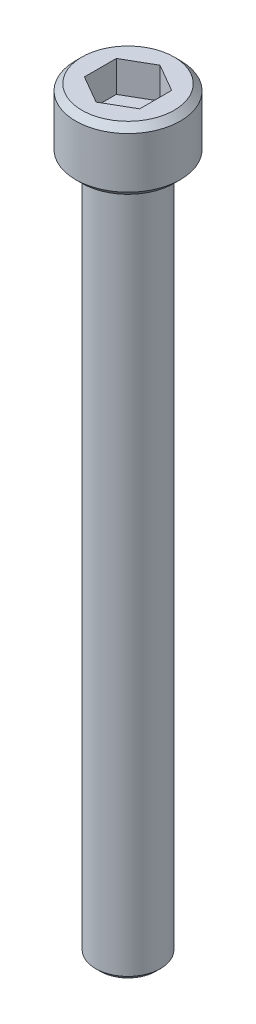
ISO-10303-21;
HEADER;
FILE_DESCRIPTION(('STEP AP214'),'2;1');
FILE_NAME('part.step','',(''),(''),'','','');
FILE_SCHEMA(('AUTOMOTIVE_DESIGN { 1 0 10303 214 1 1 1 1 }'));
ENDSEC;
DATA;
#1=APPLICATION_CONTEXT('core data for automotive mechanical design processes');
#2=APPLICATION_PROTOCOL_DEFINITION('international standard','automotive_design',2000,#1);
#3=PRODUCT_CONTEXT('',#1,'mechanical');
#4=PRODUCT('Part','Part','',(#3));
#5=PRODUCT_RELATED_PRODUCT_CATEGORY('part','',(#4));
#6=PRODUCT_DEFINITION_FORMATION('','',#4);
#7=PRODUCT_DEFINITION_CONTEXT('part definition',#1,'design');
#8=PRODUCT_DEFINITION('design','',#6,#7);
#9=PRODUCT_DEFINITION_SHAPE('','',#8);
#10=(LENGTH_UNIT() NAMED_UNIT(*) SI_UNIT(.MILLI.,.METRE.));
#11=(NAMED_UNIT(*) PLANE_ANGLE_UNIT() SI_UNIT($,.RADIAN.));
#12=(NAMED_UNIT(*) SI_UNIT($,.STERADIAN.) SOLID_ANGLE_UNIT());
#13=UNCERTAINTY_MEASURE_WITH_UNIT(LENGTH_MEASURE(1.E-05),#10,'distance_accuracy_value','');
#14=(GEOMETRIC_REPRESENTATION_CONTEXT(3) GLOBAL_UNCERTAINTY_ASSIGNED_CONTEXT((#13)) GLOBAL_UNIT_ASSIGNED_CONTEXT((#10,
#11,#12)) REPRESENTATION_CONTEXT('',''));
#15=CARTESIAN_POINT('',(0.,0.,0.));
#16=DIRECTION('',(0.,0.,1.));
#17=DIRECTION('',(1.,0.,0.));
#18=AXIS2_PLACEMENT_3D('',#15,#16,#17);
#19=CARTESIAN_POINT('',(1.778,2.064,3.07958633585746));
#20=DIRECTION('',(0.,1.,0.));
#21=DIRECTION('',(0.,0.,1.));
#22=AXIS2_PLACEMENT_3D('',#19,#20,#21);
#23=PLANE('',#22);
#24=DIRECTION('',(-0.866025403784439,0.,0.5));
#25=VECTOR('',#24,1.);
#26=CARTESIAN_POINT('',(0.,2.064,-2.05305755723831));
#27=LINE('',#26,#25);
#28=CARTESIAN_POINT('',(0.,2.064,-2.05305755723831));
#29=VERTEX_POINT('',#28);
#30=CARTESIAN_POINT('',(-1.778,2.064,-1.02652877861915));
#31=VERTEX_POINT('',#30);
#32=EDGE_CURVE('E67',#29,#31,#27,.T.);
#33=ORIENTED_EDGE('',*,*,#32,.T.);
#34=DIRECTION('',(0.,0.,1.));
#35=VECTOR('',#34,1.);
#36=CARTESIAN_POINT('',(-1.778,2.064,-1.02652877861915));
#37=LINE('',#36,#35);
#38=CARTESIAN_POINT('',(-1.778,2.064,1.02652877861916));
#39=VERTEX_POINT('',#38);
#40=EDGE_CURVE('E69',#31,#39,#37,.T.);
#41=ORIENTED_EDGE('',*,*,#40,.T.);
#42=DIRECTION('',(0.866025403784439,0.,0.499999999999999));
#43=VECTOR('',#42,1.);
#44=CARTESIAN_POINT('',(-1.778,2.064,1.02652877861916));
#45=LINE('',#44,#43);
#46=CARTESIAN_POINT('',(0.,2.064,2.05305755723831));
#47=VERTEX_POINT('',#46);
#48=EDGE_CURVE('E71',#39,#47,#45,.T.);
#49=ORIENTED_EDGE('',*,*,#48,.T.);
#50=DIRECTION('',(0.866025403784438,0.,-0.500000000000001));
#51=VECTOR('',#50,1.);
#52=CARTESIAN_POINT('',(0.,2.064,2.05305755723831));
#53=LINE('',#52,#51);
#54=CARTESIAN_POINT('',(1.778,2.064,1.02652877861915));
#55=VERTEX_POINT('',#54);
#56=EDGE_CURVE('E126',#47,#55,#53,.T.);
#57=ORIENTED_EDGE('',*,*,#56,.T.);
#58=DIRECTION('',(0.,0.,-1.));
#59=VECTOR('',#58,1.);
#60=CARTESIAN_POINT('',(1.778,2.064,1.02652877861915));
#61=LINE('',#60,#59);
#62=CARTESIAN_POINT('',(1.778,2.064,-1.02652877861916));
#63=VERTEX_POINT('',#62);
#64=EDGE_CURVE('E131',#55,#63,#61,.T.);
#65=ORIENTED_EDGE('',*,*,#64,.T.);
#66=DIRECTION('',(-0.866025403784439,0.,-0.499999999999999));
#67=VECTOR('',#66,1.);
#68=CARTESIAN_POINT('',(1.778,2.064,-1.02652877861916));
#69=LINE('',#68,#67);
#70=EDGE_CURVE('E135',#63,#29,#69,.T.);
#71=ORIENTED_EDGE('',*,*,#70,.T.);
#72=EDGE_LOOP('',(#33,#41,#49,#57,#65,#71));
#73=FACE_BOUND('',#72,.T.);
#74=ADVANCED_FACE('F16',(#73),#23,.T.);
#75=CARTESIAN_POINT('',(-1.778,2.064,1.02652877861916));
#76=DIRECTION('',(-0.499999999999999,0.,0.866025403784439));
#77=DIRECTION('',(0.866025403784439,0.,0.499999999999999));
#78=AXIS2_PLACEMENT_3D('',#75,#76,#77);
#79=PLANE('',#78);
#80=DIRECTION('',(0.,1.,0.));
#81=VECTOR('',#80,1.);
#82=CARTESIAN_POINT('',(0.,2.064,2.05305755723831));
#83=LINE('',#82,#81);
#84=CARTESIAN_POINT('',(0.,4.064,2.05305755723831));
#85=VERTEX_POINT('',#84);
#86=EDGE_CURVE('E82',#85,#47,#83,.F.);
#87=ORIENTED_EDGE('',*,*,#86,.T.);
#88=ORIENTED_EDGE('',*,*,#48,.F.);
#89=DIRECTION('',(0.,1.,0.));
#90=VECTOR('',#89,1.);
#91=CARTESIAN_POINT('',(-1.778,2.064,1.02652877861916));
#92=LINE('',#91,#90);
#93=CARTESIAN_POINT('',(-1.778,4.064,1.02652877861916));
#94=VERTEX_POINT('',#93);
#95=EDGE_CURVE('E76',#39,#94,#92,.T.);
#96=ORIENTED_EDGE('',*,*,#95,.T.);
#97=DIRECTION('',(-0.866025403784439,0.,-0.5));
#98=VECTOR('',#97,1.);
#99=CARTESIAN_POINT('',(0.,4.064,2.05305755723831));
#100=LINE('',#99,#98);
#101=EDGE_CURVE('E123',#85,#94,#100,.T.);
#102=ORIENTED_EDGE('',*,*,#101,.F.);
#103=EDGE_LOOP('',(#87,#88,#96,#102));
#104=FACE_BOUND('',#103,.T.);
#105=ADVANCED_FACE('F79',(#104),#79,.F.);
#106=CARTESIAN_POINT('',(-1.778,2.064,-1.02652877861915));
#107=DIRECTION('',(-1.,0.,0.));
#108=DIRECTION('',(0.,0.,1.));
#109=AXIS2_PLACEMENT_3D('',#106,#107,#108);
#110=PLANE('',#109);
#111=ORIENTED_EDGE('',*,*,#95,.F.);
#112=ORIENTED_EDGE('',*,*,#40,.F.);
#113=DIRECTION('',(0.,1.,0.));
#114=VECTOR('',#113,1.);
#115=CARTESIAN_POINT('',(-1.778,2.064,-1.02652877861915));
#116=LINE('',#115,#114);
#117=CARTESIAN_POINT('',(-1.778,4.064,-1.02652877861915));
#118=VERTEX_POINT('',#117);
#119=EDGE_CURVE('E90',#31,#118,#116,.T.);
#120=ORIENTED_EDGE('',*,*,#119,.T.);
#121=DIRECTION('',(0.,0.,1.));
#122=VECTOR('',#121,1.);
#123=CARTESIAN_POINT('',(-1.778,4.064,0.));
#124=LINE('',#123,#122);
#125=EDGE_CURVE('E87',#94,#118,#124,.F.);
#126=ORIENTED_EDGE('',*,*,#125,.F.);
#127=EDGE_LOOP('',(#111,#112,#120,#126));
#128=FACE_BOUND('',#127,.T.);
#129=ADVANCED_FACE('F85',(#128),#110,.F.);
#130=CARTESIAN_POINT('',(0.,2.064,-2.05305755723831));
#131=DIRECTION('',(-0.5,0.,-0.866025403784439));
#132=DIRECTION('',(-0.866025403784439,0.,0.5));
#133=AXIS2_PLACEMENT_3D('',#130,#131,#132);
#134=PLANE('',#133);
#135=ORIENTED_EDGE('',*,*,#119,.F.);
#136=ORIENTED_EDGE('',*,*,#32,.F.);
#137=DIRECTION('',(0.,1.,0.));
#138=VECTOR('',#137,1.);
#139=CARTESIAN_POINT('',(0.,2.064,-2.05305755723831));
#140=LINE('',#139,#138);
#141=CARTESIAN_POINT('',(0.,4.064,-2.05305755723831));
#142=VERTEX_POINT('',#141);
#143=EDGE_CURVE('E133',#29,#142,#140,.T.);
#144=ORIENTED_EDGE('',*,*,#143,.T.);
#145=DIRECTION('',(0.866025403784438,0.,-0.5));
#146=VECTOR('',#145,1.);
#147=CARTESIAN_POINT('',(-1.778,4.064,-1.02652877861915));
#148=LINE('',#147,#146);
#149=EDGE_CURVE('E119',#118,#142,#148,.T.);
#150=ORIENTED_EDGE('',*,*,#149,.F.);
#151=EDGE_LOOP('',(#135,#136,#144,#150));
#152=FACE_BOUND('',#151,.T.);
#153=ADVANCED_FACE('F138',(#152),#134,.F.);
#154=CARTESIAN_POINT('',(1.778,2.064,-1.02652877861916));
#155=DIRECTION('',(0.499999999999999,0.,-0.866025403784439));
#156=DIRECTION('',(-0.866025403784439,0.,-0.499999999999999));
#157=AXIS2_PLACEMENT_3D('',#154,#155,#156);
#158=PLANE('',#157);
#159=ORIENTED_EDGE('',*,*,#143,.F.);
#160=ORIENTED_EDGE('',*,*,#70,.F.);
#161=DIRECTION('',(0.,1.,0.));
#162=VECTOR('',#161,1.);
#163=CARTESIAN_POINT('',(1.778,2.064,-1.02652877861916));
#164=LINE('',#163,#162);
#165=CARTESIAN_POINT('',(1.778,4.064,-1.02652877861916));
#166=VERTEX_POINT('',#165);
#167=EDGE_CURVE('E129',#63,#166,#164,.T.);
#168=ORIENTED_EDGE('',*,*,#167,.T.);
#169=DIRECTION('',(0.866025403784439,0.,0.5));
#170=VECTOR('',#169,1.);
#171=CARTESIAN_POINT('',(0.,4.064,-2.05305755723831));
#172=LINE('',#171,#170);
#173=EDGE_CURVE('E116',#142,#166,#172,.T.);
#174=ORIENTED_EDGE('',*,*,#173,.F.);
#175=EDGE_LOOP('',(#159,#160,#168,#174));
#176=FACE_BOUND('',#175,.T.);
#177=ADVANCED_FACE('F150',(#176),#158,.F.);
#178=CARTESIAN_POINT('',(1.778,2.064,1.02652877861915));
#179=DIRECTION('',(1.,0.,0.));
#180=DIRECTION('',(0.,0.,-1.));
#181=AXIS2_PLACEMENT_3D('',#178,#179,#180);
#182=PLANE('',#181);
#183=ORIENTED_EDGE('',*,*,#167,.F.);
#184=ORIENTED_EDGE('',*,*,#64,.F.);
#185=DIRECTION('',(0.,1.,0.));
#186=VECTOR('',#185,1.);
#187=CARTESIAN_POINT('',(1.778,2.064,1.02652877861915));
#188=LINE('',#187,#186);
#189=CARTESIAN_POINT('',(1.778,4.064,1.02652877861915));
#190=VERTEX_POINT('',#189);
#191=EDGE_CURVE('E34',#55,#190,#188,.T.);
#192=ORIENTED_EDGE('',*,*,#191,.T.);
#193=DIRECTION('',(0.,0.,1.));
#194=VECTOR('',#193,1.);
#195=CARTESIAN_POINT('',(1.778,4.064,0.));
#196=LINE('',#195,#194);
#197=EDGE_CURVE('E113',#166,#190,#196,.T.);
#198=ORIENTED_EDGE('',*,*,#197,.F.);
#199=EDGE_LOOP('',(#183,#184,#192,#198));
#200=FACE_BOUND('',#199,.T.);
#201=ADVANCED_FACE('F148',(#200),#182,.F.);
#202=CARTESIAN_POINT('',(0.,2.064,2.05305755723831));
#203=DIRECTION('',(0.500000000000001,0.,0.866025403784438));
#204=DIRECTION('',(0.866025403784438,0.,-0.500000000000001));
#205=AXIS2_PLACEMENT_3D('',#202,#203,#204);
#206=PLANE('',#205);
#207=ORIENTED_EDGE('',*,*,#191,.F.);
#208=ORIENTED_EDGE('',*,*,#56,.F.);
#209=ORIENTED_EDGE('',*,*,#86,.F.);
#210=DIRECTION('',(-0.866025403784438,0.,0.500000000000001));
#211=VECTOR('',#210,1.);
#212=CARTESIAN_POINT('',(1.778,4.064,1.02652877861915));
#213=LINE('',#212,#211);
#214=EDGE_CURVE('E110',#190,#85,#213,.T.);
#215=ORIENTED_EDGE('',*,*,#214,.F.);
#216=EDGE_LOOP('',(#207,#208,#209,#215));
#217=FACE_BOUND('',#216,.T.);
#218=ADVANCED_FACE('F145',(#217),#206,.F.);
#219=CARTESIAN_POINT('',(0.,4.064,0.));
#220=DIRECTION('',(0.,1.,0.));
#221=DIRECTION('',(0.,0.,1.));
#222=AXIS2_PLACEMENT_3D('',#219,#220,#221);
#223=PLANE('',#222);
#224=ORIENTED_EDGE('',*,*,#197,.T.);
#225=ORIENTED_EDGE('',*,*,#214,.T.);
#226=ORIENTED_EDGE('',*,*,#101,.T.);
#227=ORIENTED_EDGE('',*,*,#125,.T.);
#228=ORIENTED_EDGE('',*,*,#149,.T.);
#229=ORIENTED_EDGE('',*,*,#173,.T.);
#230=EDGE_LOOP('',(#224,#225,#226,#227,#228,#229));
#231=FACE_BOUND('',#230,.T.);
#232=CARTESIAN_POINT('',(0.,4.06400000002805,0.));
#233=DIRECTION('',(0.,-1.,0.));
#234=DIRECTION('',(0.,0.,-1.));
#235=AXIS2_PLACEMENT_3D('',#232,#233,#234);
#236=CIRCLE('',#235,2.96550000001616);
#237=CARTESIAN_POINT('',(0.,4.06400000002805,-2.96550000001616));
#238=VERTEX_POINT('',#237);
#239=EDGE_CURVE('E19',#238,#238,#236,.T.);
#240=ORIENTED_EDGE('',*,*,#239,.F.);
#241=EDGE_LOOP('',(#240));
#242=FACE_BOUND('',#241,.T.);
#243=ADVANCED_FACE('F142',(#231,#242),#223,.T.);
#244=CARTESIAN_POINT('',(0.,3.66400000001477,0.));
#245=DIRECTION('',(0.,-1.,0.));
#246=DIRECTION('',(0.,0.,-1.));
#247=AXIS2_PLACEMENT_3D('',#244,#245,#246);
#248=CONICAL_SURFACE('',#247,3.36550000002944,0.785398163397448);
#249=ORIENTED_EDGE('',*,*,#239,.T.);
#250=EDGE_LOOP('',(#249));
#251=FACE_BOUND('',#250,.T.);
#252=CARTESIAN_POINT('',(0.,3.66400000000001,0.));
#253=DIRECTION('',(0.,-1.,0.));
#254=DIRECTION('',(0.,0.,-1.));
#255=AXIS2_PLACEMENT_3D('',#252,#253,#254);
#256=CIRCLE('',#255,3.3655);
#257=CARTESIAN_POINT('',(0.,3.66400000000001,-3.3655));
#258=VERTEX_POINT('',#257);
#259=EDGE_CURVE('E102',#258,#258,#256,.T.);
#260=ORIENTED_EDGE('',*,*,#259,.F.);
#261=EDGE_LOOP('',(#260));
#262=FACE_BOUND('',#261,.T.);
#263=ADVANCED_FACE('F187',(#251,#262),#248,.T.);
#264=CARTESIAN_POINT('',(0.,4.064,0.));
#265=DIRECTION('',(0.,-1.,0.));
#266=DIRECTION('',(0.,0.,-1.));
#267=AXIS2_PLACEMENT_3D('',#264,#265,#266);
#268=CYLINDRICAL_SURFACE('',#267,3.3655);
#269=ORIENTED_EDGE('',*,*,#259,.T.);
#270=EDGE_LOOP('',(#269));
#271=FACE_BOUND('',#270,.T.);
#272=CARTESIAN_POINT('',(0.,0.400000000070122,0.));
#273=DIRECTION('',(0.,1.,0.));
#274=DIRECTION('',(0.,0.,1.));
#275=AXIS2_PLACEMENT_3D('',#272,#273,#274);
#276=CIRCLE('',#275,3.36550000002944);
#277=CARTESIAN_POINT('',(0.,0.400000000070122,3.36550000002944));
#278=VERTEX_POINT('',#277);
#279=EDGE_CURVE('E98',#278,#278,#276,.F.);
#280=ORIENTED_EDGE('',*,*,#279,.F.);
#281=EDGE_LOOP('',(#280));
#282=FACE_BOUND('',#281,.T.);
#283=ADVANCED_FACE('F183',(#271,#282),#268,.T.);
#284=CARTESIAN_POINT('',(0.,-44.45,0.));
#285=DIRECTION('',(0.,1.,0.));
#286=DIRECTION('',(0.,0.,1.));
#287=AXIS2_PLACEMENT_3D('',#284,#285,#286);
#288=PLANE('',#287);
#289=CARTESIAN_POINT('',(0.,-44.4499999999834,0.));
#290=DIRECTION('',(0.,1.,0.));
#291=DIRECTION('',(0.,0.,1.));
#292=AXIS2_PLACEMENT_3D('',#289,#290,#291);
#293=CIRCLE('',#292,1.78280000000086);
#294=CARTESIAN_POINT('',(0.,-44.4499999999834,1.78280000000086));
#295=VERTEX_POINT('',#294);
#296=EDGE_CURVE('E96',#295,#295,#293,.T.);
#297=ORIENTED_EDGE('',*,*,#296,.F.);
#298=EDGE_LOOP('',(#297));
#299=FACE_BOUND('',#298,.T.);
#300=ADVANCED_FACE('F179',(#299),#288,.F.);
#301=CARTESIAN_POINT('',(0.,0.399999999956435,0.));
#302=DIRECTION('',(0.,1.,0.));
#303=DIRECTION('',(0.,0.,1.));
#304=AXIS2_PLACEMENT_3D('',#301,#302,#303);
#305=CONICAL_SURFACE('',#304,3.36549999991576,0.785398163397448);
#306=CARTESIAN_POINT('',(0.,0.,0.));
#307=DIRECTION('',(0.,1.,0.));
#308=DIRECTION('',(0.,0.,1.));
#309=AXIS2_PLACEMENT_3D('',#306,#307,#308);
#310=CIRCLE('',#309,2.96549999995932);
#311=CARTESIAN_POINT('',(0.,0.,2.96549999995932));
#312=VERTEX_POINT('',#311);
#313=EDGE_CURVE('E94',#312,#312,#310,.T.);
#314=ORIENTED_EDGE('',*,*,#313,.T.);
#315=EDGE_LOOP('',(#314));
#316=FACE_BOUND('',#315,.T.);
#317=ORIENTED_EDGE('',*,*,#279,.T.);
#318=EDGE_LOOP('',(#317));
#319=FACE_BOUND('',#318,.T.);
#320=ADVANCED_FACE('F175',(#316,#319),#305,.T.);
#321=CARTESIAN_POINT('',(0.,-44.1500000000019,0.));
#322=DIRECTION('',(0.,1.,0.));
#323=DIRECTION('',(0.,0.,1.));
#324=AXIS2_PLACEMENT_3D('',#321,#322,#323);
#325=CONICAL_SURFACE('',#324,2.0827999999824,0.785398163397448);
#326=CARTESIAN_POINT('',(0.,-44.15,0.));
#327=DIRECTION('',(0.,1.,0.));
#328=DIRECTION('',(0.,0.,1.));
#329=AXIS2_PLACEMENT_3D('',#326,#327,#328);
#330=CIRCLE('',#329,2.0828);
#331=CARTESIAN_POINT('',(0.,-44.15,2.0828));
#332=VERTEX_POINT('',#331);
#333=EDGE_CURVE('E25',#332,#332,#330,.T.);
#334=ORIENTED_EDGE('',*,*,#333,.F.);
#335=EDGE_LOOP('',(#334));
#336=FACE_BOUND('',#335,.T.);
#337=ORIENTED_EDGE('',*,*,#296,.T.);
#338=EDGE_LOOP('',(#337));
#339=FACE_BOUND('',#338,.T.);
#340=ADVANCED_FACE('F168',(#336,#339),#325,.T.);
#341=CARTESIAN_POINT('',(0.,0.,0.));
#342=DIRECTION('',(0.,1.,0.));
#343=DIRECTION('',(0.,0.,1.));
#344=AXIS2_PLACEMENT_3D('',#341,#342,#343);
#345=PLANE('',#344);
#346=CARTESIAN_POINT('',(0.,0.,0.));
#347=DIRECTION('',(0.,1.,0.));
#348=DIRECTION('',(0.,0.,1.));
#349=AXIS2_PLACEMENT_3D('',#346,#347,#348);
#350=CIRCLE('',#349,2.0828);
#351=CARTESIAN_POINT('',(0.,0.,2.0828));
#352=VERTEX_POINT('',#351);
#353=EDGE_CURVE('E11',#352,#352,#350,.F.);
#354=ORIENTED_EDGE('',*,*,#353,.F.);
#355=EDGE_LOOP('',(#354));
#356=FACE_BOUND('',#355,.T.);
#357=ORIENTED_EDGE('',*,*,#313,.F.);
#358=EDGE_LOOP('',(#357));
#359=FACE_BOUND('',#358,.T.);
#360=ADVANCED_FACE('F162',(#356,#359),#345,.F.);
#361=CARTESIAN_POINT('',(0.,-44.45,0.));
#362=DIRECTION('',(0.,1.,0.));
#363=DIRECTION('',(0.,0.,1.));
#364=AXIS2_PLACEMENT_3D('',#361,#362,#363);
#365=CYLINDRICAL_SURFACE('',#364,2.0828);
#366=ORIENTED_EDGE('',*,*,#353,.T.);
#367=EDGE_LOOP('',(#366));
#368=FACE_BOUND('',#367,.T.);
#369=ORIENTED_EDGE('',*,*,#333,.T.);
#370=EDGE_LOOP('',(#369));
#371=FACE_BOUND('',#370,.T.);
#372=ADVANCED_FACE('F160',(#368,#371),#365,.T.);
#373=CLOSED_SHELL('',(#74,#105,#129,#153,#177,#201,#218,#243,#263,#283,#300,#320,#340,#360,#372));
#374=MANIFOLD_SOLID_BREP('B1',#373);
#375=ADVANCED_BREP_SHAPE_REPRESENTATION('',(#18,#374),#14);
#376=SHAPE_DEFINITION_REPRESENTATION(#9,#375);
ENDSEC;
END-ISO-10303-21;
